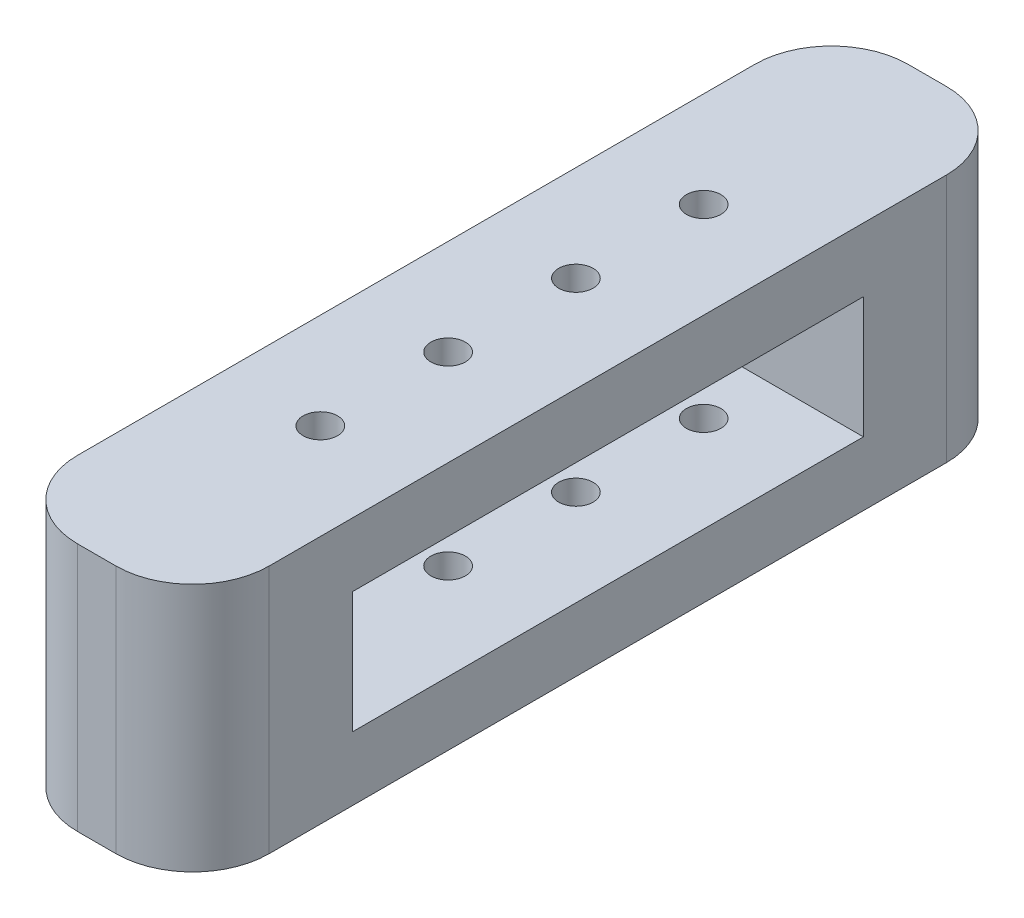
ISO-10303-21;
HEADER;
FILE_DESCRIPTION(('STEP AP214'),'2;1');
FILE_NAME('part.step','',(''),(''),'','','');
FILE_SCHEMA(('AUTOMOTIVE_DESIGN { 1 0 10303 214 1 1 1 1 }'));
ENDSEC;
DATA;
#1=APPLICATION_CONTEXT('core data for automotive mechanical design processes');
#2=APPLICATION_PROTOCOL_DEFINITION('international standard','automotive_design',2000,#1);
#3=PRODUCT_CONTEXT('',#1,'mechanical');
#4=PRODUCT('Part','Part','',(#3));
#5=PRODUCT_RELATED_PRODUCT_CATEGORY('part','',(#4));
#6=PRODUCT_DEFINITION_FORMATION('','',#4);
#7=PRODUCT_DEFINITION_CONTEXT('part definition',#1,'design');
#8=PRODUCT_DEFINITION('design','',#6,#7);
#9=PRODUCT_DEFINITION_SHAPE('','',#8);
#10=(LENGTH_UNIT() NAMED_UNIT(*) SI_UNIT(.MILLI.,.METRE.));
#11=(NAMED_UNIT(*) PLANE_ANGLE_UNIT() SI_UNIT($,.RADIAN.));
#12=(NAMED_UNIT(*) SI_UNIT($,.STERADIAN.) SOLID_ANGLE_UNIT());
#13=UNCERTAINTY_MEASURE_WITH_UNIT(LENGTH_MEASURE(1.E-05),#10,'distance_accuracy_value','');
#14=(GEOMETRIC_REPRESENTATION_CONTEXT(3) GLOBAL_UNCERTAINTY_ASSIGNED_CONTEXT((#13)) GLOBAL_UNIT_ASSIGNED_CONTEXT((#10,
#11,#12)) REPRESENTATION_CONTEXT('',''));
#15=CARTESIAN_POINT('',(0.,0.,0.));
#16=DIRECTION('',(0.,0.,1.));
#17=DIRECTION('',(1.,0.,0.));
#18=AXIS2_PLACEMENT_3D('',#15,#16,#17);
#19=CARTESIAN_POINT('',(0.,19.5,17.5));
#20=DIRECTION('',(0.,-1.,0.));
#21=DIRECTION('',(0.,0.,-1.));
#22=AXIS2_PLACEMENT_3D('',#19,#20,#21);
#23=CYLINDRICAL_SURFACE('',#22,1.35);
#24=CARTESIAN_POINT('',(0.,5.,17.5));
#25=DIRECTION('',(0.,-1.,0.));
#26=DIRECTION('',(0.,0.,-1.));
#27=AXIS2_PLACEMENT_3D('',#24,#25,#26);
#28=CIRCLE('',#27,1.35);
#29=CARTESIAN_POINT('',(0.,5.,16.15));
#30=VERTEX_POINT('',#29);
#31=EDGE_CURVE('E178',#30,#30,#28,.T.);
#32=ORIENTED_EDGE('',*,*,#31,.F.);
#33=EDGE_LOOP('',(#32));
#34=FACE_BOUND('',#33,.T.);
#35=CARTESIAN_POINT('',(0.,0.,17.5));
#36=DIRECTION('',(0.,1.,0.));
#37=DIRECTION('',(0.,0.,1.));
#38=AXIS2_PLACEMENT_3D('',#35,#36,#37);
#39=CIRCLE('',#38,1.35);
#40=CARTESIAN_POINT('',(0.,0.,18.85));
#41=VERTEX_POINT('',#40);
#42=EDGE_CURVE('E200',#41,#41,#39,.T.);
#43=ORIENTED_EDGE('',*,*,#42,.F.);
#44=EDGE_LOOP('',(#43));
#45=FACE_BOUND('',#44,.T.);
#46=ADVANCED_FACE('F43',(#34,#45),#23,.F.);
#47=CARTESIAN_POINT('',(0.,19.5,27.5));
#48=DIRECTION('',(0.,-1.,0.));
#49=DIRECTION('',(0.,0.,-1.));
#50=AXIS2_PLACEMENT_3D('',#47,#48,#49);
#51=CYLINDRICAL_SURFACE('',#50,1.35);
#52=CARTESIAN_POINT('',(0.,5.,27.5));
#53=DIRECTION('',(0.,-1.,0.));
#54=DIRECTION('',(0.,0.,-1.));
#55=AXIS2_PLACEMENT_3D('',#52,#53,#54);
#56=CIRCLE('',#55,1.35);
#57=CARTESIAN_POINT('',(0.,5.,26.15));
#58=VERTEX_POINT('',#57);
#59=EDGE_CURVE('E175',#58,#58,#56,.T.);
#60=ORIENTED_EDGE('',*,*,#59,.F.);
#61=EDGE_LOOP('',(#60));
#62=FACE_BOUND('',#61,.T.);
#63=CARTESIAN_POINT('',(0.,0.,27.5));
#64=DIRECTION('',(0.,1.,0.));
#65=DIRECTION('',(0.,0.,1.));
#66=AXIS2_PLACEMENT_3D('',#63,#64,#65);
#67=CIRCLE('',#66,1.35);
#68=CARTESIAN_POINT('',(0.,0.,28.85));
#69=VERTEX_POINT('',#68);
#70=EDGE_CURVE('E194',#69,#69,#67,.T.);
#71=ORIENTED_EDGE('',*,*,#70,.F.);
#72=EDGE_LOOP('',(#71));
#73=FACE_BOUND('',#72,.T.);
#74=ADVANCED_FACE('F290',(#62,#73),#51,.F.);
#75=CARTESIAN_POINT('',(0.,19.5,37.5));
#76=DIRECTION('',(0.,-1.,0.));
#77=DIRECTION('',(0.,0.,-1.));
#78=AXIS2_PLACEMENT_3D('',#75,#76,#77);
#79=CYLINDRICAL_SURFACE('',#78,1.35);
#80=CARTESIAN_POINT('',(0.,5.,37.5));
#81=DIRECTION('',(0.,-1.,0.));
#82=DIRECTION('',(0.,0.,-1.));
#83=AXIS2_PLACEMENT_3D('',#80,#81,#82);
#84=CIRCLE('',#83,1.35);
#85=CARTESIAN_POINT('',(0.,5.,36.15));
#86=VERTEX_POINT('',#85);
#87=EDGE_CURVE('E172',#86,#86,#84,.T.);
#88=ORIENTED_EDGE('',*,*,#87,.F.);
#89=EDGE_LOOP('',(#88));
#90=FACE_BOUND('',#89,.T.);
#91=CARTESIAN_POINT('',(0.,0.,37.5));
#92=DIRECTION('',(0.,1.,0.));
#93=DIRECTION('',(0.,0.,1.));
#94=AXIS2_PLACEMENT_3D('',#91,#92,#93);
#95=CIRCLE('',#94,1.35);
#96=CARTESIAN_POINT('',(0.,0.,38.85));
#97=VERTEX_POINT('',#96);
#98=EDGE_CURVE('E188',#97,#97,#95,.T.);
#99=ORIENTED_EDGE('',*,*,#98,.F.);
#100=EDGE_LOOP('',(#99));
#101=FACE_BOUND('',#100,.T.);
#102=ADVANCED_FACE('F297',(#90,#101),#79,.F.);
#103=CARTESIAN_POINT('',(0.,19.5,47.5));
#104=DIRECTION('',(0.,-1.,0.));
#105=DIRECTION('',(0.,0.,-1.));
#106=AXIS2_PLACEMENT_3D('',#103,#104,#105);
#107=CYLINDRICAL_SURFACE('',#106,1.35);
#108=CARTESIAN_POINT('',(0.,5.,47.5));
#109=DIRECTION('',(0.,-1.,0.));
#110=DIRECTION('',(0.,0.,-1.));
#111=AXIS2_PLACEMENT_3D('',#108,#109,#110);
#112=CIRCLE('',#111,1.35);
#113=CARTESIAN_POINT('',(0.,5.,46.15));
#114=VERTEX_POINT('',#113);
#115=EDGE_CURVE('E171',#114,#114,#112,.T.);
#116=ORIENTED_EDGE('',*,*,#115,.F.);
#117=EDGE_LOOP('',(#116));
#118=FACE_BOUND('',#117,.T.);
#119=CARTESIAN_POINT('',(0.,0.,47.5));
#120=DIRECTION('',(0.,1.,0.));
#121=DIRECTION('',(0.,0.,1.));
#122=AXIS2_PLACEMENT_3D('',#119,#120,#121);
#123=CIRCLE('',#122,1.35);
#124=CARTESIAN_POINT('',(0.,0.,48.85));
#125=VERTEX_POINT('',#124);
#126=EDGE_CURVE('E184',#125,#125,#123,.T.);
#127=ORIENTED_EDGE('',*,*,#126,.F.);
#128=EDGE_LOOP('',(#127));
#129=FACE_BOUND('',#128,.T.);
#130=ADVANCED_FACE('F324',(#118,#129),#107,.F.);
#131=CARTESIAN_POINT('',(0.,19.5,0.));
#132=DIRECTION('',(0.,1.,0.));
#133=DIRECTION('',(0.,0.,1.));
#134=AXIS2_PLACEMENT_3D('',#131,#132,#133);
#135=PLANE('',#134);
#136=CARTESIAN_POINT('',(0.,19.5,37.5));
#137=DIRECTION('',(0.,1.,0.));
#138=DIRECTION('',(0.,0.,1.));
#139=AXIS2_PLACEMENT_3D('',#136,#137,#138);
#140=CIRCLE('',#139,1.35);
#141=CARTESIAN_POINT('',(0.,19.5,38.85));
#142=VERTEX_POINT('',#141);
#143=EDGE_CURVE('E191',#142,#142,#140,.T.);
#144=ORIENTED_EDGE('',*,*,#143,.F.);
#145=EDGE_LOOP('',(#144));
#146=FACE_BOUND('',#145,.T.);
#147=CARTESIAN_POINT('',(0.,19.5,17.5));
#148=DIRECTION('',(0.,1.,0.));
#149=DIRECTION('',(0.,0.,1.));
#150=AXIS2_PLACEMENT_3D('',#147,#148,#149);
#151=CIRCLE('',#150,1.35);
#152=CARTESIAN_POINT('',(0.,19.5,18.85));
#153=VERTEX_POINT('',#152);
#154=EDGE_CURVE('E203',#153,#153,#151,.T.);
#155=ORIENTED_EDGE('',*,*,#154,.F.);
#156=EDGE_LOOP('',(#155));
#157=FACE_BOUND('',#156,.T.);
#158=DIRECTION('',(0.,0.,1.));
#159=VECTOR('',#158,1.);
#160=CARTESIAN_POINT('',(-7.5,19.5,0.));
#161=LINE('',#160,#159);
#162=CARTESIAN_POINT('',(-7.5,19.5,6.));
#163=VERTEX_POINT('',#162);
#164=CARTESIAN_POINT('',(-7.49999999999999,19.5,59.));
#165=VERTEX_POINT('',#164);
#166=EDGE_CURVE('E209',#163,#165,#161,.T.);
#167=ORIENTED_EDGE('',*,*,#166,.T.);
#168=CARTESIAN_POINT('',(-1.49999999999999,19.5,59.));
#169=DIRECTION('',(0.,1.,0.));
#170=DIRECTION('',(0.,0.,1.));
#171=AXIS2_PLACEMENT_3D('',#168,#169,#170);
#172=CIRCLE('',#171,6.);
#173=CARTESIAN_POINT('',(-1.49999999999999,19.5,65.));
#174=VERTEX_POINT('',#173);
#175=EDGE_CURVE('E256',#165,#174,#172,.T.);
#176=ORIENTED_EDGE('',*,*,#175,.T.);
#177=DIRECTION('',(1.,0.,0.));
#178=VECTOR('',#177,1.);
#179=CARTESIAN_POINT('',(-7.49999999999999,19.5,65.));
#180=LINE('',#179,#178);
#181=CARTESIAN_POINT('',(1.50000000000001,19.5,65.));
#182=VERTEX_POINT('',#181);
#183=EDGE_CURVE('E212',#174,#182,#180,.T.);
#184=ORIENTED_EDGE('',*,*,#183,.T.);
#185=CARTESIAN_POINT('',(1.50000000000001,19.5,59.));
#186=DIRECTION('',(0.,1.,0.));
#187=DIRECTION('',(0.,0.,1.));
#188=AXIS2_PLACEMENT_3D('',#185,#186,#187);
#189=CIRCLE('',#188,6.);
#190=CARTESIAN_POINT('',(7.50000000000001,19.5,59.));
#191=VERTEX_POINT('',#190);
#192=EDGE_CURVE('E254',#182,#191,#189,.T.);
#193=ORIENTED_EDGE('',*,*,#192,.T.);
#194=DIRECTION('',(0.,0.,-1.));
#195=VECTOR('',#194,1.);
#196=CARTESIAN_POINT('',(7.5,19.5,0.));
#197=LINE('',#196,#195);
#198=CARTESIAN_POINT('',(7.5,19.5,6.));
#199=VERTEX_POINT('',#198);
#200=EDGE_CURVE('E216',#191,#199,#197,.T.);
#201=ORIENTED_EDGE('',*,*,#200,.T.);
#202=CARTESIAN_POINT('',(1.5,19.5,6.));
#203=DIRECTION('',(0.,1.,0.));
#204=DIRECTION('',(0.,0.,1.));
#205=AXIS2_PLACEMENT_3D('',#202,#203,#204);
#206=CIRCLE('',#205,6.);
#207=CARTESIAN_POINT('',(1.5,19.5,0.));
#208=VERTEX_POINT('',#207);
#209=EDGE_CURVE('E250',#199,#208,#206,.T.);
#210=ORIENTED_EDGE('',*,*,#209,.T.);
#211=DIRECTION('',(-1.,0.,0.));
#212=VECTOR('',#211,1.);
#213=CARTESIAN_POINT('',(-7.5,19.5,0.));
#214=LINE('',#213,#212);
#215=CARTESIAN_POINT('',(-1.5,19.5,0.));
#216=VERTEX_POINT('',#215);
#217=EDGE_CURVE('E219',#208,#216,#214,.T.);
#218=ORIENTED_EDGE('',*,*,#217,.T.);
#219=CARTESIAN_POINT('',(-1.5,19.5,6.));
#220=DIRECTION('',(0.,1.,0.));
#221=DIRECTION('',(0.,0.,1.));
#222=AXIS2_PLACEMENT_3D('',#219,#220,#221);
#223=CIRCLE('',#222,6.);
#224=EDGE_CURVE('E252',#216,#163,#223,.T.);
#225=ORIENTED_EDGE('',*,*,#224,.T.);
#226=EDGE_LOOP('',(#167,#176,#184,#193,#201,#210,#218,#225));
#227=FACE_BOUND('',#226,.T.);
#228=CARTESIAN_POINT('',(0.,19.5,27.5));
#229=DIRECTION('',(0.,1.,0.));
#230=DIRECTION('',(0.,0.,1.));
#231=AXIS2_PLACEMENT_3D('',#228,#229,#230);
#232=CIRCLE('',#231,1.35);
#233=CARTESIAN_POINT('',(0.,19.5,28.85));
#234=VERTEX_POINT('',#233);
#235=EDGE_CURVE('E197',#234,#234,#232,.T.);
#236=ORIENTED_EDGE('',*,*,#235,.F.);
#237=EDGE_LOOP('',(#236));
#238=FACE_BOUND('',#237,.T.);
#239=CARTESIAN_POINT('',(0.,19.5,47.5));
#240=DIRECTION('',(0.,1.,0.));
#241=DIRECTION('',(0.,0.,1.));
#242=AXIS2_PLACEMENT_3D('',#239,#240,#241);
#243=CIRCLE('',#242,1.35);
#244=CARTESIAN_POINT('',(0.,19.5,48.85));
#245=VERTEX_POINT('',#244);
#246=EDGE_CURVE('E185',#245,#245,#243,.T.);
#247=ORIENTED_EDGE('',*,*,#246,.F.);
#248=EDGE_LOOP('',(#247));
#249=FACE_BOUND('',#248,.T.);
#250=ADVANCED_FACE('F320',(#146,#157,#227,#238,#249),#135,.T.);
#251=CARTESIAN_POINT('',(0.,0.,0.));
#252=DIRECTION('',(0.,1.,0.));
#253=DIRECTION('',(0.,0.,1.));
#254=AXIS2_PLACEMENT_3D('',#251,#252,#253);
#255=PLANE('',#254);
#256=DIRECTION('',(1.,0.,0.));
#257=VECTOR('',#256,1.);
#258=CARTESIAN_POINT('',(-7.49999999999999,0.,65.));
#259=LINE('',#258,#257);
#260=CARTESIAN_POINT('',(-1.49999999999999,0.,65.));
#261=VERTEX_POINT('',#260);
#262=CARTESIAN_POINT('',(1.50000000000001,0.,65.));
#263=VERTEX_POINT('',#262);
#264=EDGE_CURVE('E225',#261,#263,#259,.T.);
#265=ORIENTED_EDGE('',*,*,#264,.F.);
#266=CARTESIAN_POINT('',(-1.49999999999999,0.,59.));
#267=DIRECTION('',(0.,1.,0.));
#268=DIRECTION('',(0.,0.,1.));
#269=AXIS2_PLACEMENT_3D('',#266,#267,#268);
#270=CIRCLE('',#269,6.);
#271=CARTESIAN_POINT('',(-7.49999999999999,0.,59.));
#272=VERTEX_POINT('',#271);
#273=EDGE_CURVE('E243',#261,#272,#270,.F.);
#274=ORIENTED_EDGE('',*,*,#273,.T.);
#275=DIRECTION('',(0.,0.,1.));
#276=VECTOR('',#275,1.);
#277=CARTESIAN_POINT('',(-7.5,0.,0.));
#278=LINE('',#277,#276);
#279=CARTESIAN_POINT('',(-7.5,0.,6.));
#280=VERTEX_POINT('',#279);
#281=EDGE_CURVE('E206',#280,#272,#278,.T.);
#282=ORIENTED_EDGE('',*,*,#281,.F.);
#283=CARTESIAN_POINT('',(-1.5,0.,6.));
#284=DIRECTION('',(0.,1.,0.));
#285=DIRECTION('',(0.,0.,1.));
#286=AXIS2_PLACEMENT_3D('',#283,#284,#285);
#287=CIRCLE('',#286,6.);
#288=CARTESIAN_POINT('',(-1.5,0.,0.));
#289=VERTEX_POINT('',#288);
#290=EDGE_CURVE('E239',#280,#289,#287,.F.);
#291=ORIENTED_EDGE('',*,*,#290,.T.);
#292=DIRECTION('',(-1.,0.,0.));
#293=VECTOR('',#292,1.);
#294=CARTESIAN_POINT('',(-7.5,0.,0.));
#295=LINE('',#294,#293);
#296=CARTESIAN_POINT('',(1.5,0.,0.));
#297=VERTEX_POINT('',#296);
#298=EDGE_CURVE('E213',#297,#289,#295,.T.);
#299=ORIENTED_EDGE('',*,*,#298,.F.);
#300=CARTESIAN_POINT('',(1.5,0.,6.));
#301=DIRECTION('',(0.,1.,0.));
#302=DIRECTION('',(0.,0.,1.));
#303=AXIS2_PLACEMENT_3D('',#300,#301,#302);
#304=CIRCLE('',#303,6.);
#305=CARTESIAN_POINT('',(7.5,0.,6.));
#306=VERTEX_POINT('',#305);
#307=EDGE_CURVE('E237',#297,#306,#304,.F.);
#308=ORIENTED_EDGE('',*,*,#307,.T.);
#309=DIRECTION('',(0.,0.,-1.));
#310=VECTOR('',#309,1.);
#311=CARTESIAN_POINT('',(7.5,0.,0.));
#312=LINE('',#311,#310);
#313=CARTESIAN_POINT('',(7.50000000000001,0.,59.));
#314=VERTEX_POINT('',#313);
#315=EDGE_CURVE('E228',#314,#306,#312,.T.);
#316=ORIENTED_EDGE('',*,*,#315,.F.);
#317=CARTESIAN_POINT('',(1.50000000000001,0.,59.));
#318=DIRECTION('',(0.,1.,0.));
#319=DIRECTION('',(0.,0.,1.));
#320=AXIS2_PLACEMENT_3D('',#317,#318,#319);
#321=CIRCLE('',#320,6.);
#322=EDGE_CURVE('E241',#314,#263,#321,.F.);
#323=ORIENTED_EDGE('',*,*,#322,.T.);
#324=EDGE_LOOP('',(#265,#274,#282,#291,#299,#308,#316,#323));
#325=FACE_BOUND('',#324,.T.);
#326=ORIENTED_EDGE('',*,*,#42,.T.);
#327=EDGE_LOOP('',(#326));
#328=FACE_BOUND('',#327,.T.);
#329=ORIENTED_EDGE('',*,*,#70,.T.);
#330=EDGE_LOOP('',(#329));
#331=FACE_BOUND('',#330,.T.);
#332=ORIENTED_EDGE('',*,*,#98,.T.);
#333=EDGE_LOOP('',(#332));
#334=FACE_BOUND('',#333,.T.);
#335=ORIENTED_EDGE('',*,*,#126,.T.);
#336=EDGE_LOOP('',(#335));
#337=FACE_BOUND('',#336,.T.);
#338=ADVANCED_FACE('F323',(#325,#328,#331,#334,#337),#255,.F.);
#339=CARTESIAN_POINT('',(-7.5,19.5,0.));
#340=DIRECTION('',(1.,0.,0.));
#341=DIRECTION('',(0.,0.,-1.));
#342=AXIS2_PLACEMENT_3D('',#339,#340,#341);
#343=PLANE('',#342);
#344=DIRECTION('',(0.,0.,-1.));
#345=VECTOR('',#344,1.);
#346=CARTESIAN_POINT('',(-7.5,14.5,12.5));
#347=LINE('',#346,#345);
#348=CARTESIAN_POINT('',(-7.49999999999999,14.5,52.5));
#349=VERTEX_POINT('',#348);
#350=CARTESIAN_POINT('',(-7.5,14.5,12.5));
#351=VERTEX_POINT('',#350);
#352=EDGE_CURVE('E143',#349,#351,#347,.T.);
#353=ORIENTED_EDGE('',*,*,#352,.F.);
#354=DIRECTION('',(0.,1.,0.));
#355=VECTOR('',#354,1.);
#356=CARTESIAN_POINT('',(-7.49999999999999,14.5,52.5));
#357=LINE('',#356,#355);
#358=CARTESIAN_POINT('',(-7.49999999999999,5.,52.5));
#359=VERTEX_POINT('',#358);
#360=EDGE_CURVE('E58',#359,#349,#357,.T.);
#361=ORIENTED_EDGE('',*,*,#360,.F.);
#362=DIRECTION('',(0.,0.,1.));
#363=VECTOR('',#362,1.);
#364=CARTESIAN_POINT('',(-7.5,5.,12.5));
#365=LINE('',#364,#363);
#366=CARTESIAN_POINT('',(-7.5,5.,12.5));
#367=VERTEX_POINT('',#366);
#368=EDGE_CURVE('E150',#367,#359,#365,.T.);
#369=ORIENTED_EDGE('',*,*,#368,.F.);
#370=DIRECTION('',(0.,-1.,0.));
#371=VECTOR('',#370,1.);
#372=CARTESIAN_POINT('',(-7.5,14.5,12.5));
#373=LINE('',#372,#371);
#374=EDGE_CURVE('E135',#351,#367,#373,.T.);
#375=ORIENTED_EDGE('',*,*,#374,.F.);
#376=EDGE_LOOP('',(#353,#361,#369,#375));
#377=FACE_BOUND('',#376,.T.);
#378=ORIENTED_EDGE('',*,*,#281,.T.);
#379=DIRECTION('',(0.,-1.,0.));
#380=VECTOR('',#379,1.);
#381=CARTESIAN_POINT('',(-7.49999999999999,19.5,59.));
#382=LINE('',#381,#380);
#383=EDGE_CURVE('E248',#272,#165,#382,.F.);
#384=ORIENTED_EDGE('',*,*,#383,.T.);
#385=ORIENTED_EDGE('',*,*,#166,.F.);
#386=DIRECTION('',(0.,-1.,0.));
#387=VECTOR('',#386,1.);
#388=CARTESIAN_POINT('',(-7.5,19.5,6.));
#389=LINE('',#388,#387);
#390=EDGE_CURVE('E245',#163,#280,#389,.T.);
#391=ORIENTED_EDGE('',*,*,#390,.T.);
#392=EDGE_LOOP('',(#378,#384,#385,#391));
#393=FACE_BOUND('',#392,.T.);
#394=ADVANCED_FACE('F147',(#377,#393),#343,.F.);
#395=CARTESIAN_POINT('',(-7.49999999999999,19.5,65.));
#396=DIRECTION('',(0.,0.,-1.));
#397=DIRECTION('',(-1.,0.,0.));
#398=AXIS2_PLACEMENT_3D('',#395,#396,#397);
#399=PLANE('',#398);
#400=ORIENTED_EDGE('',*,*,#183,.F.);
#401=DIRECTION('',(0.,-1.,0.));
#402=VECTOR('',#401,1.);
#403=CARTESIAN_POINT('',(-1.49999999999999,19.5,65.));
#404=LINE('',#403,#402);
#405=EDGE_CURVE('E234',#174,#261,#404,.T.);
#406=ORIENTED_EDGE('',*,*,#405,.T.);
#407=ORIENTED_EDGE('',*,*,#264,.T.);
#408=DIRECTION('',(0.,-1.,0.));
#409=VECTOR('',#408,1.);
#410=CARTESIAN_POINT('',(1.50000000000001,19.5,65.));
#411=LINE('',#410,#409);
#412=EDGE_CURVE('E222',#263,#182,#411,.F.);
#413=ORIENTED_EDGE('',*,*,#412,.T.);
#414=EDGE_LOOP('',(#400,#406,#407,#413));
#415=FACE_BOUND('',#414,.T.);
#416=ADVANCED_FACE('F367',(#415),#399,.F.);
#417=CARTESIAN_POINT('',(7.5,19.5,0.));
#418=DIRECTION('',(-1.,0.,0.));
#419=DIRECTION('',(0.,0.,1.));
#420=AXIS2_PLACEMENT_3D('',#417,#418,#419);
#421=PLANE('',#420);
#422=DIRECTION('',(0.,0.,1.));
#423=VECTOR('',#422,1.);
#424=CARTESIAN_POINT('',(7.5,5.,0.));
#425=LINE('',#424,#423);
#426=CARTESIAN_POINT('',(7.5,5.,12.5));
#427=VERTEX_POINT('',#426);
#428=CARTESIAN_POINT('',(7.5,5.,52.5));
#429=VERTEX_POINT('',#428);
#430=EDGE_CURVE('E181',#427,#429,#425,.T.);
#431=ORIENTED_EDGE('',*,*,#430,.T.);
#432=DIRECTION('',(0.,1.,0.));
#433=VECTOR('',#432,1.);
#434=CARTESIAN_POINT('',(7.50000000000001,19.5,52.5));
#435=LINE('',#434,#433);
#436=CARTESIAN_POINT('',(7.5,14.5,52.5));
#437=VERTEX_POINT('',#436);
#438=EDGE_CURVE('E11',#429,#437,#435,.T.);
#439=ORIENTED_EDGE('',*,*,#438,.T.);
#440=DIRECTION('',(0.,0.,-1.));
#441=VECTOR('',#440,1.);
#442=CARTESIAN_POINT('',(7.5,14.5,0.));
#443=LINE('',#442,#441);
#444=CARTESIAN_POINT('',(7.5,14.5,12.5));
#445=VERTEX_POINT('',#444);
#446=EDGE_CURVE('E169',#437,#445,#443,.T.);
#447=ORIENTED_EDGE('',*,*,#446,.T.);
#448=DIRECTION('',(0.,-1.,0.));
#449=VECTOR('',#448,1.);
#450=CARTESIAN_POINT('',(7.5,19.5,12.5));
#451=LINE('',#450,#449);
#452=EDGE_CURVE('E51',#445,#427,#451,.T.);
#453=ORIENTED_EDGE('',*,*,#452,.T.);
#454=EDGE_LOOP('',(#431,#439,#447,#453));
#455=FACE_BOUND('',#454,.T.);
#456=ORIENTED_EDGE('',*,*,#200,.F.);
#457=DIRECTION('',(0.,-1.,0.));
#458=VECTOR('',#457,1.);
#459=CARTESIAN_POINT('',(7.50000000000001,19.5,59.));
#460=LINE('',#459,#458);
#461=EDGE_CURVE('E260',#191,#314,#460,.T.);
#462=ORIENTED_EDGE('',*,*,#461,.T.);
#463=ORIENTED_EDGE('',*,*,#315,.T.);
#464=DIRECTION('',(0.,-1.,0.));
#465=VECTOR('',#464,1.);
#466=CARTESIAN_POINT('',(7.5,19.5,6.));
#467=LINE('',#466,#465);
#468=EDGE_CURVE('E258',#306,#199,#467,.F.);
#469=ORIENTED_EDGE('',*,*,#468,.T.);
#470=EDGE_LOOP('',(#456,#462,#463,#469));
#471=FACE_BOUND('',#470,.T.);
#472=ADVANCED_FACE('F272',(#455,#471),#421,.F.);
#473=CARTESIAN_POINT('',(-7.5,19.5,0.));
#474=DIRECTION('',(0.,0.,1.));
#475=DIRECTION('',(1.,0.,0.));
#476=AXIS2_PLACEMENT_3D('',#473,#474,#475);
#477=PLANE('',#476);
#478=ORIENTED_EDGE('',*,*,#298,.T.);
#479=DIRECTION('',(0.,-1.,0.));
#480=VECTOR('',#479,1.);
#481=CARTESIAN_POINT('',(-1.5,19.5,0.));
#482=LINE('',#481,#480);
#483=EDGE_CURVE('E266',#289,#216,#482,.F.);
#484=ORIENTED_EDGE('',*,*,#483,.T.);
#485=ORIENTED_EDGE('',*,*,#217,.F.);
#486=DIRECTION('',(0.,-1.,0.));
#487=VECTOR('',#486,1.);
#488=CARTESIAN_POINT('',(1.5,19.5,0.));
#489=LINE('',#488,#487);
#490=EDGE_CURVE('E263',#208,#297,#489,.T.);
#491=ORIENTED_EDGE('',*,*,#490,.T.);
#492=EDGE_LOOP('',(#478,#484,#485,#491));
#493=FACE_BOUND('',#492,.T.);
#494=ADVANCED_FACE('F305',(#493),#477,.F.);
#495=CARTESIAN_POINT('',(0.,14.5,17.5));
#496=DIRECTION('',(0.,1.,0.));
#497=DIRECTION('',(0.,0.,1.));
#498=AXIS2_PLACEMENT_3D('',#495,#496,#497);
#499=CIRCLE('',#498,1.35);
#500=CARTESIAN_POINT('',(0.,14.5,18.85));
#501=VERTEX_POINT('',#500);
#502=EDGE_CURVE('E166',#501,#501,#499,.T.);
#503=ORIENTED_EDGE('',*,*,#502,.F.);
#504=EDGE_LOOP('',(#503));
#505=FACE_BOUND('',#504,.T.);
#506=ORIENTED_EDGE('',*,*,#154,.T.);
#507=EDGE_LOOP('',(#506));
#508=FACE_BOUND('',#507,.T.);
#509=ADVANCED_FACE('F293',(#505,#508),#23,.F.);
#510=CARTESIAN_POINT('',(0.,14.5,27.5));
#511=DIRECTION('',(0.,1.,0.));
#512=DIRECTION('',(0.,0.,1.));
#513=AXIS2_PLACEMENT_3D('',#510,#511,#512);
#514=CIRCLE('',#513,1.35);
#515=CARTESIAN_POINT('',(0.,14.5,28.85));
#516=VERTEX_POINT('',#515);
#517=EDGE_CURVE('E163',#516,#516,#514,.T.);
#518=ORIENTED_EDGE('',*,*,#517,.F.);
#519=EDGE_LOOP('',(#518));
#520=FACE_BOUND('',#519,.T.);
#521=ORIENTED_EDGE('',*,*,#235,.T.);
#522=EDGE_LOOP('',(#521));
#523=FACE_BOUND('',#522,.T.);
#524=ADVANCED_FACE('F300',(#520,#523),#51,.F.);
#525=CARTESIAN_POINT('',(0.,14.5,37.5));
#526=DIRECTION('',(0.,1.,0.));
#527=DIRECTION('',(0.,0.,1.));
#528=AXIS2_PLACEMENT_3D('',#525,#526,#527);
#529=CIRCLE('',#528,1.35);
#530=CARTESIAN_POINT('',(0.,14.5,38.85));
#531=VERTEX_POINT('',#530);
#532=EDGE_CURVE('E160',#531,#531,#529,.T.);
#533=ORIENTED_EDGE('',*,*,#532,.F.);
#534=EDGE_LOOP('',(#533));
#535=FACE_BOUND('',#534,.T.);
#536=ORIENTED_EDGE('',*,*,#143,.T.);
#537=EDGE_LOOP('',(#536));
#538=FACE_BOUND('',#537,.T.);
#539=ADVANCED_FACE('F311',(#535,#538),#79,.F.);
#540=CARTESIAN_POINT('',(0.,14.5,47.5));
#541=DIRECTION('',(0.,1.,0.));
#542=DIRECTION('',(0.,0.,1.));
#543=AXIS2_PLACEMENT_3D('',#540,#541,#542);
#544=CIRCLE('',#543,1.35);
#545=CARTESIAN_POINT('',(0.,14.5,48.85));
#546=VERTEX_POINT('',#545);
#547=EDGE_CURVE('E157',#546,#546,#544,.T.);
#548=ORIENTED_EDGE('',*,*,#547,.F.);
#549=EDGE_LOOP('',(#548));
#550=FACE_BOUND('',#549,.T.);
#551=ORIENTED_EDGE('',*,*,#246,.T.);
#552=EDGE_LOOP('',(#551));
#553=FACE_BOUND('',#552,.T.);
#554=ADVANCED_FACE('F333',(#550,#553),#107,.F.);
#555=CARTESIAN_POINT('',(-1.49999999999999,19.5,59.));
#556=DIRECTION('',(0.,-1.,0.));
#557=DIRECTION('',(0.,0.,-1.));
#558=AXIS2_PLACEMENT_3D('',#555,#556,#557);
#559=CYLINDRICAL_SURFACE('',#558,6.);
#560=ORIENTED_EDGE('',*,*,#175,.F.);
#561=ORIENTED_EDGE('',*,*,#383,.F.);
#562=ORIENTED_EDGE('',*,*,#273,.F.);
#563=ORIENTED_EDGE('',*,*,#405,.F.);
#564=EDGE_LOOP('',(#560,#561,#562,#563));
#565=FACE_BOUND('',#564,.T.);
#566=ADVANCED_FACE('F335',(#565),#559,.T.);
#567=CARTESIAN_POINT('',(1.50000000000001,19.5,59.));
#568=DIRECTION('',(0.,-1.,0.));
#569=DIRECTION('',(0.,0.,-1.));
#570=AXIS2_PLACEMENT_3D('',#567,#568,#569);
#571=CYLINDRICAL_SURFACE('',#570,6.);
#572=ORIENTED_EDGE('',*,*,#192,.F.);
#573=ORIENTED_EDGE('',*,*,#412,.F.);
#574=ORIENTED_EDGE('',*,*,#322,.F.);
#575=ORIENTED_EDGE('',*,*,#461,.F.);
#576=EDGE_LOOP('',(#572,#573,#574,#575));
#577=FACE_BOUND('',#576,.T.);
#578=ADVANCED_FACE('F343',(#577),#571,.T.);
#579=CARTESIAN_POINT('',(-1.5,19.5,6.));
#580=DIRECTION('',(0.,-1.,0.));
#581=DIRECTION('',(0.,0.,-1.));
#582=AXIS2_PLACEMENT_3D('',#579,#580,#581);
#583=CYLINDRICAL_SURFACE('',#582,6.);
#584=ORIENTED_EDGE('',*,*,#224,.F.);
#585=ORIENTED_EDGE('',*,*,#483,.F.);
#586=ORIENTED_EDGE('',*,*,#290,.F.);
#587=ORIENTED_EDGE('',*,*,#390,.F.);
#588=EDGE_LOOP('',(#584,#585,#586,#587));
#589=FACE_BOUND('',#588,.T.);
#590=ADVANCED_FACE('F376',(#589),#583,.T.);
#591=CARTESIAN_POINT('',(1.5,19.5,6.));
#592=DIRECTION('',(0.,-1.,0.));
#593=DIRECTION('',(0.,0.,-1.));
#594=AXIS2_PLACEMENT_3D('',#591,#592,#593);
#595=CYLINDRICAL_SURFACE('',#594,6.);
#596=ORIENTED_EDGE('',*,*,#209,.F.);
#597=ORIENTED_EDGE('',*,*,#468,.F.);
#598=ORIENTED_EDGE('',*,*,#307,.F.);
#599=ORIENTED_EDGE('',*,*,#490,.F.);
#600=EDGE_LOOP('',(#596,#597,#598,#599));
#601=FACE_BOUND('',#600,.T.);
#602=ADVANCED_FACE('F45',(#601),#595,.T.);
#603=CARTESIAN_POINT('',(12.5,14.5,52.5));
#604=DIRECTION('',(0.,0.,1.));
#605=DIRECTION('',(1.,0.,0.));
#606=AXIS2_PLACEMENT_3D('',#603,#604,#605);
#607=PLANE('',#606);
#608=DIRECTION('',(-1.,0.,0.));
#609=VECTOR('',#608,1.);
#610=CARTESIAN_POINT('',(12.5,5.,52.5));
#611=LINE('',#610,#609);
#612=EDGE_CURVE('E155',#429,#359,#611,.T.);
#613=ORIENTED_EDGE('',*,*,#612,.T.);
#614=ORIENTED_EDGE('',*,*,#360,.T.);
#615=DIRECTION('',(-1.,0.,0.));
#616=VECTOR('',#615,1.);
#617=CARTESIAN_POINT('',(12.5,14.5,52.5));
#618=LINE('',#617,#616);
#619=EDGE_CURVE('E140',#437,#349,#618,.T.);
#620=ORIENTED_EDGE('',*,*,#619,.F.);
#621=ORIENTED_EDGE('',*,*,#438,.F.);
#622=EDGE_LOOP('',(#613,#614,#620,#621));
#623=FACE_BOUND('',#622,.T.);
#624=ADVANCED_FACE('F274',(#623),#607,.F.);
#625=CARTESIAN_POINT('',(12.5,14.5,12.5));
#626=DIRECTION('',(0.,0.,-1.));
#627=DIRECTION('',(-1.,0.,0.));
#628=AXIS2_PLACEMENT_3D('',#625,#626,#627);
#629=PLANE('',#628);
#630=DIRECTION('',(-1.,0.,0.));
#631=VECTOR('',#630,1.);
#632=CARTESIAN_POINT('',(12.5,14.5,12.5));
#633=LINE('',#632,#631);
#634=EDGE_CURVE('E66',#445,#351,#633,.T.);
#635=ORIENTED_EDGE('',*,*,#634,.T.);
#636=ORIENTED_EDGE('',*,*,#374,.T.);
#637=DIRECTION('',(-1.,0.,0.));
#638=VECTOR('',#637,1.);
#639=CARTESIAN_POINT('',(12.5,5.,12.5));
#640=LINE('',#639,#638);
#641=EDGE_CURVE('E139',#427,#367,#640,.T.);
#642=ORIENTED_EDGE('',*,*,#641,.F.);
#643=ORIENTED_EDGE('',*,*,#452,.F.);
#644=EDGE_LOOP('',(#635,#636,#642,#643));
#645=FACE_BOUND('',#644,.T.);
#646=ADVANCED_FACE('F132',(#645),#629,.F.);
#647=CARTESIAN_POINT('',(12.5,5.,12.5));
#648=DIRECTION('',(0.,-1.,0.));
#649=DIRECTION('',(0.,0.,-1.));
#650=AXIS2_PLACEMENT_3D('',#647,#648,#649);
#651=PLANE('',#650);
#652=ORIENTED_EDGE('',*,*,#31,.T.);
#653=EDGE_LOOP('',(#652));
#654=FACE_BOUND('',#653,.T.);
#655=ORIENTED_EDGE('',*,*,#59,.T.);
#656=EDGE_LOOP('',(#655));
#657=FACE_BOUND('',#656,.T.);
#658=ORIENTED_EDGE('',*,*,#87,.T.);
#659=EDGE_LOOP('',(#658));
#660=FACE_BOUND('',#659,.T.);
#661=ORIENTED_EDGE('',*,*,#115,.T.);
#662=EDGE_LOOP('',(#661));
#663=FACE_BOUND('',#662,.T.);
#664=ORIENTED_EDGE('',*,*,#641,.T.);
#665=ORIENTED_EDGE('',*,*,#368,.T.);
#666=ORIENTED_EDGE('',*,*,#612,.F.);
#667=ORIENTED_EDGE('',*,*,#430,.F.);
#668=EDGE_LOOP('',(#664,#665,#666,#667));
#669=FACE_BOUND('',#668,.T.);
#670=ADVANCED_FACE('F277',(#654,#657,#660,#663,#669),#651,.F.);
#671=CARTESIAN_POINT('',(12.5,14.5,12.5));
#672=DIRECTION('',(0.,1.,0.));
#673=DIRECTION('',(0.,0.,1.));
#674=AXIS2_PLACEMENT_3D('',#671,#672,#673);
#675=PLANE('',#674);
#676=ORIENTED_EDGE('',*,*,#502,.T.);
#677=EDGE_LOOP('',(#676));
#678=FACE_BOUND('',#677,.T.);
#679=ORIENTED_EDGE('',*,*,#517,.T.);
#680=EDGE_LOOP('',(#679));
#681=FACE_BOUND('',#680,.T.);
#682=ORIENTED_EDGE('',*,*,#532,.T.);
#683=EDGE_LOOP('',(#682));
#684=FACE_BOUND('',#683,.T.);
#685=ORIENTED_EDGE('',*,*,#547,.T.);
#686=EDGE_LOOP('',(#685));
#687=FACE_BOUND('',#686,.T.);
#688=ORIENTED_EDGE('',*,*,#619,.T.);
#689=ORIENTED_EDGE('',*,*,#352,.T.);
#690=ORIENTED_EDGE('',*,*,#634,.F.);
#691=ORIENTED_EDGE('',*,*,#446,.F.);
#692=EDGE_LOOP('',(#688,#689,#690,#691));
#693=FACE_BOUND('',#692,.T.);
#694=ADVANCED_FACE('F144',(#678,#681,#684,#687,#693),#675,.F.);
#695=CLOSED_SHELL('',(#46,#74,#102,#130,#250,#338,#394,#416,#472,#494,#509,#524,#539,#554,#566,
#578,#590,#602,#624,#646,#670,#694));
#696=MANIFOLD_SOLID_BREP('B2',#695);
#697=ADVANCED_BREP_SHAPE_REPRESENTATION('',(#18,#696),#14);
#698=SHAPE_DEFINITION_REPRESENTATION(#9,#697);
ENDSEC;
END-ISO-10303-21;
